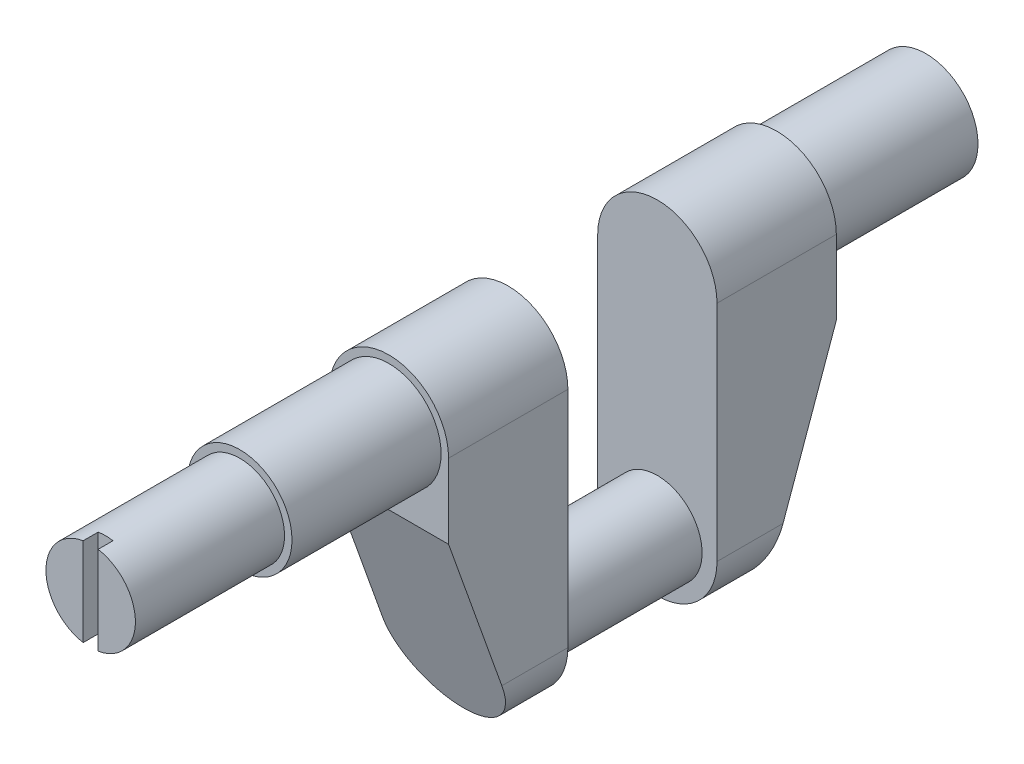
ISO-10303-21;
HEADER;
FILE_DESCRIPTION(('STEP AP214'),'2;1');
FILE_NAME('part.step','',(''),(''),'','','');
FILE_SCHEMA(('AUTOMOTIVE_DESIGN { 1 0 10303 214 1 1 1 1 }'));
ENDSEC;
DATA;
#1=APPLICATION_CONTEXT('core data for automotive mechanical design processes');
#2=APPLICATION_PROTOCOL_DEFINITION('international standard','automotive_design',2000,#1);
#3=PRODUCT_CONTEXT('',#1,'mechanical');
#4=PRODUCT('Part','Part','',(#3));
#5=PRODUCT_RELATED_PRODUCT_CATEGORY('part','',(#4));
#6=PRODUCT_DEFINITION_FORMATION('','',#4);
#7=PRODUCT_DEFINITION_CONTEXT('part definition',#1,'design');
#8=PRODUCT_DEFINITION('design','',#6,#7);
#9=PRODUCT_DEFINITION_SHAPE('','',#8);
#10=(LENGTH_UNIT() NAMED_UNIT(*) SI_UNIT(.MILLI.,.METRE.));
#11=(NAMED_UNIT(*) PLANE_ANGLE_UNIT() SI_UNIT($,.RADIAN.));
#12=(NAMED_UNIT(*) SI_UNIT($,.STERADIAN.) SOLID_ANGLE_UNIT());
#13=UNCERTAINTY_MEASURE_WITH_UNIT(LENGTH_MEASURE(1.E-05),#10,'distance_accuracy_value','');
#14=(GEOMETRIC_REPRESENTATION_CONTEXT(3) GLOBAL_UNCERTAINTY_ASSIGNED_CONTEXT((#13)) GLOBAL_UNIT_ASSIGNED_CONTEXT((#10,
#11,#12)) REPRESENTATION_CONTEXT('',''));
#15=CARTESIAN_POINT('',(0.,0.,0.));
#16=DIRECTION('',(0.,0.,1.));
#17=DIRECTION('',(1.,0.,0.));
#18=AXIS2_PLACEMENT_3D('',#15,#16,#17);
#19=CARTESIAN_POINT('',(1.32575280215063,12.0467012794756,36.7349651815675));
#20=DIRECTION('',(-1.,0.,0.));
#21=DIRECTION('',(0.,0.,1.));
#22=AXIS2_PLACEMENT_3D('',#19,#20,#21);
#23=PLANE('',#22);
#24=DIRECTION('',(0.,0.,1.));
#25=VECTOR('',#24,1.);
#26=CARTESIAN_POINT('',(1.32575280215063,3.11721675198663,23.9016318482341));
#27=LINE('',#26,#25);
#28=CARTESIAN_POINT('',(1.32575280215063,3.11721675198663,35.4516318482342));
#29=VERTEX_POINT('',#28);
#30=CARTESIAN_POINT('',(1.32575280215063,3.11721675198663,36.7349651815675));
#31=VERTEX_POINT('',#30);
#32=EDGE_CURVE('E59',#29,#31,#27,.T.);
#33=ORIENTED_EDGE('',*,*,#32,.F.);
#34=DIRECTION('',(0.,-1.,0.));
#35=VECTOR('',#34,1.);
#36=CARTESIAN_POINT('',(1.32575280215063,1.78003461280888,35.4516318482342));
#37=LINE('',#36,#35);
#38=CARTESIAN_POINT('',(1.32575280215063,10.7095191402978,35.4516318482342));
#39=VERTEX_POINT('',#38);
#40=EDGE_CURVE('E50',#39,#29,#37,.T.);
#41=ORIENTED_EDGE('',*,*,#40,.F.);
#42=DIRECTION('',(0.,0.,-1.));
#43=VECTOR('',#42,1.);
#44=CARTESIAN_POINT('',(1.32575280215063,10.7095191402978,23.9016318482341));
#45=LINE('',#44,#43);
#46=CARTESIAN_POINT('',(1.32575280215063,10.7095191402978,36.7349651815675));
#47=VERTEX_POINT('',#46);
#48=EDGE_CURVE('E347',#47,#39,#45,.T.);
#49=ORIENTED_EDGE('',*,*,#48,.F.);
#50=DIRECTION('',(0.,1.,0.));
#51=VECTOR('',#50,1.);
#52=CARTESIAN_POINT('',(1.32575280215063,9.48003461280889,36.7349651815675));
#53=LINE('',#52,#51);
#54=EDGE_CURVE('E199',#31,#47,#53,.T.);
#55=ORIENTED_EDGE('',*,*,#54,.F.);
#56=EDGE_LOOP('',(#33,#41,#49,#55));
#57=FACE_BOUND('',#56,.T.);
#58=ADVANCED_FACE('F39',(#57),#23,.F.);
#59=CARTESIAN_POINT('',(2.60908613548396,1.78003461280888,36.7349651815675));
#60=DIRECTION('',(1.,0.,0.));
#61=DIRECTION('',(0.,0.,-1.));
#62=AXIS2_PLACEMENT_3D('',#59,#60,#61);
#63=PLANE('',#62);
#64=DIRECTION('',(0.,0.,-1.));
#65=VECTOR('',#64,1.);
#66=CARTESIAN_POINT('',(2.60908613548396,3.11721675198663,23.9016318482341));
#67=LINE('',#66,#65);
#68=CARTESIAN_POINT('',(2.60908613548396,3.11721675198663,36.7349651815675));
#69=VERTEX_POINT('',#68);
#70=CARTESIAN_POINT('',(2.60908613548396,3.11721675198663,35.4516318482342));
#71=VERTEX_POINT('',#70);
#72=EDGE_CURVE('E201',#69,#71,#67,.T.);
#73=ORIENTED_EDGE('',*,*,#72,.F.);
#74=DIRECTION('',(0.,-1.,0.));
#75=VECTOR('',#74,1.);
#76=CARTESIAN_POINT('',(2.60908613548396,4.34670127947555,36.7349651815675));
#77=LINE('',#76,#75);
#78=CARTESIAN_POINT('',(2.60908613548396,10.7095191402978,36.7349651815675));
#79=VERTEX_POINT('',#78);
#80=EDGE_CURVE('E261',#79,#69,#77,.T.);
#81=ORIENTED_EDGE('',*,*,#80,.F.);
#82=DIRECTION('',(0.,0.,1.));
#83=VECTOR('',#82,1.);
#84=CARTESIAN_POINT('',(2.60908613548396,10.7095191402978,23.9016318482341));
#85=LINE('',#84,#83);
#86=CARTESIAN_POINT('',(2.60908613548396,10.7095191402978,35.4516318482342));
#87=VERTEX_POINT('',#86);
#88=EDGE_CURVE('E218',#87,#79,#85,.T.);
#89=ORIENTED_EDGE('',*,*,#88,.F.);
#90=DIRECTION('',(0.,1.,0.));
#91=VECTOR('',#90,1.);
#92=CARTESIAN_POINT('',(2.60908613548396,12.0467012794756,35.4516318482342));
#93=LINE('',#92,#91);
#94=EDGE_CURVE('E11',#71,#87,#93,.T.);
#95=ORIENTED_EDGE('',*,*,#94,.F.);
#96=EDGE_LOOP('',(#73,#81,#89,#95));
#97=FACE_BOUND('',#96,.T.);
#98=ADVANCED_FACE('F41',(#97),#63,.F.);
#99=CARTESIAN_POINT('',(1.96741946881729,6.91336794614222,35.4516318482342));
#100=DIRECTION('',(0.,0.,1.));
#101=DIRECTION('',(1.,0.,0.));
#102=AXIS2_PLACEMENT_3D('',#99,#100,#101);
#103=PLANE('',#102);
#104=CARTESIAN_POINT('',(1.96741946881729,6.91336794614222,35.4516318482342));
#105=DIRECTION('',(0.,0.,-1.));
#106=DIRECTION('',(-1.,0.,0.));
#107=AXIS2_PLACEMENT_3D('',#104,#105,#106);
#108=CIRCLE('',#107,3.85);
#109=EDGE_CURVE('E204',#71,#29,#108,.T.);
#110=ORIENTED_EDGE('',*,*,#109,.F.);
#111=ORIENTED_EDGE('',*,*,#94,.T.);
#112=CARTESIAN_POINT('',(1.96741946881729,6.91336794614222,35.4516318482342));
#113=DIRECTION('',(0.,0.,-1.));
#114=DIRECTION('',(-1.,0.,0.));
#115=AXIS2_PLACEMENT_3D('',#112,#113,#114);
#116=CIRCLE('',#115,3.85);
#117=EDGE_CURVE('E258',#39,#87,#116,.T.);
#118=ORIENTED_EDGE('',*,*,#117,.F.);
#119=ORIENTED_EDGE('',*,*,#40,.T.);
#120=EDGE_LOOP('',(#110,#111,#118,#119));
#121=FACE_BOUND('',#120,.T.);
#122=ADVANCED_FACE('F289',(#121),#103,.T.);
#123=CARTESIAN_POINT('',(1.96741946881729,6.91336794614222,36.7349651815675));
#124=DIRECTION('',(0.,0.,-1.));
#125=DIRECTION('',(-1.,0.,0.));
#126=AXIS2_PLACEMENT_3D('',#123,#124,#125);
#127=PLANE('',#126);
#128=ORIENTED_EDGE('',*,*,#80,.T.);
#129=CARTESIAN_POINT('',(1.96741946881729,6.91336794614222,36.7349651815675));
#130=DIRECTION('',(0.,0.,-1.));
#131=DIRECTION('',(-1.,0.,0.));
#132=AXIS2_PLACEMENT_3D('',#129,#130,#131);
#133=CIRCLE('',#132,3.85);
#134=EDGE_CURVE('E203',#79,#69,#133,.T.);
#135=ORIENTED_EDGE('',*,*,#134,.F.);
#136=EDGE_LOOP('',(#128,#135));
#137=FACE_BOUND('',#136,.T.);
#138=ADVANCED_FACE('F307',(#137),#127,.F.);
#139=CARTESIAN_POINT('',(1.96741946881729,6.91336794614222,36.7349651815675));
#140=DIRECTION('',(0.,0.,-1.));
#141=DIRECTION('',(-1.,0.,0.));
#142=AXIS2_PLACEMENT_3D('',#139,#140,#141);
#143=PLANE('',#142);
#144=ORIENTED_EDGE('',*,*,#54,.T.);
#145=CARTESIAN_POINT('',(1.96741946881729,6.91336794614222,36.7349651815675));
#146=DIRECTION('',(0.,0.,-1.));
#147=DIRECTION('',(-1.,0.,0.));
#148=AXIS2_PLACEMENT_3D('',#145,#146,#147);
#149=CIRCLE('',#148,3.85);
#150=EDGE_CURVE('E343',#31,#47,#149,.T.);
#151=ORIENTED_EDGE('',*,*,#150,.F.);
#152=EDGE_LOOP('',(#144,#151));
#153=FACE_BOUND('',#152,.T.);
#154=ADVANCED_FACE('F310',(#153),#143,.F.);
#155=CARTESIAN_POINT('',(7.10075280215063,-17.4699653871911,-15.8817014850992));
#156=DIRECTION('',(0.,-0.336336396998156,-0.941741911594837));
#157=DIRECTION('',(-1.,0.,0.));
#158=AXIS2_PLACEMENT_3D('',#155,#156,#157);
#159=PLANE('',#158);
#160=DIRECTION('',(0.,-0.941741911594838,0.336336396998156));
#161=VECTOR('',#160,1.);
#162=CARTESIAN_POINT('',(-3.16591386451604,-15.8033741353057,-16.4769126464868));
#163=LINE('',#162,#161);
#164=CARTESIAN_POINT('',(-3.16591386451604,0.496701279475554,-22.2983681517659));
#165=VERTEX_POINT('',#164);
#166=CARTESIAN_POINT('',(-3.16591386451604,-12.3366320538578,-17.7150348184325));
#167=VERTEX_POINT('',#166);
#168=EDGE_CURVE('E339',#165,#167,#163,.T.);
#169=ORIENTED_EDGE('',*,*,#168,.F.);
#170=DIRECTION('',(-1.,0.,0.));
#171=VECTOR('',#170,1.);
#172=CARTESIAN_POINT('',(4.53408613548396,0.496701279475555,-22.2983681517659));
#173=LINE('',#172,#171);
#174=CARTESIAN_POINT('',(7.10075280215063,0.496701279475554,-22.2983681517659));
#175=VERTEX_POINT('',#174);
#176=EDGE_CURVE('E262',#175,#165,#173,.T.);
#177=ORIENTED_EDGE('',*,*,#176,.F.);
#178=DIRECTION('',(0.,0.941741911594838,-0.336336396998156));
#179=VECTOR('',#178,1.);
#180=CARTESIAN_POINT('',(7.10075280215063,-7.26717504028312,-19.5255551804235));
#181=LINE('',#180,#179);
#182=CARTESIAN_POINT('',(7.10075280215063,-12.3366320538578,-17.7150348184325));
#183=VERTEX_POINT('',#182);
#184=EDGE_CURVE('E373',#183,#175,#181,.T.);
#185=ORIENTED_EDGE('',*,*,#184,.F.);
#186=CARTESIAN_POINT('',(1.96741946881729,-12.3366320538578,-17.7150348184325));
#187=DIRECTION('',(0.,0.336336396998156,0.941741911594837));
#188=DIRECTION('',(0.,-0.941741911594837,0.336336396998156));
#189=AXIS2_PLACEMENT_3D('',#186,#187,#188);
#190=ELLIPSE('',#189,5.45089187401679,5.13333333333333);
#191=EDGE_CURVE('E205',#167,#183,#190,.T.);
#192=ORIENTED_EDGE('',*,*,#191,.F.);
#193=EDGE_LOOP('',(#169,#177,#185,#192));
#194=FACE_BOUND('',#193,.T.);
#195=ADVANCED_FACE('F314',(#194),#159,.T.);
#196=CARTESIAN_POINT('',(-3.16591386451604,-12.3366320538578,-12.0317014850992));
#197=DIRECTION('',(1.,0.,0.));
#198=DIRECTION('',(0.,0.,-1.));
#199=AXIS2_PLACEMENT_3D('',#196,#197,#198);
#200=PLANE('',#199);
#201=ORIENTED_EDGE('',*,*,#168,.T.);
#202=DIRECTION('',(0.,0.,-1.));
#203=VECTOR('',#202,1.);
#204=CARTESIAN_POINT('',(-3.16591386451604,-12.3366320538578,-12.0317014850992));
#205=LINE('',#204,#203);
#206=CARTESIAN_POINT('',(-3.16591386451604,-12.3366320538578,-12.0317014850992));
#207=VERTEX_POINT('',#206);
#208=EDGE_CURVE('E209',#207,#167,#205,.T.);
#209=ORIENTED_EDGE('',*,*,#208,.F.);
#210=DIRECTION('',(0.,-1.,0.));
#211=VECTOR('',#210,1.);
#212=CARTESIAN_POINT('',(-3.16591386451604,6.91336794614222,-12.0317014850992));
#213=LINE('',#212,#211);
#214=CARTESIAN_POINT('',(-3.16591386451604,6.91336794614222,-12.0317014850992));
#215=VERTEX_POINT('',#214);
#216=EDGE_CURVE('E226',#215,#207,#213,.T.);
#217=ORIENTED_EDGE('',*,*,#216,.F.);
#218=DIRECTION('',(0.,0.,-1.));
#219=VECTOR('',#218,1.);
#220=CARTESIAN_POINT('',(-3.16591386451604,6.91336794614222,-12.0317014850992));
#221=LINE('',#220,#219);
#222=CARTESIAN_POINT('',(-3.16591386451604,6.91336794614222,-22.2983681517659));
#223=VERTEX_POINT('',#222);
#224=EDGE_CURVE('E208',#215,#223,#221,.T.);
#225=ORIENTED_EDGE('',*,*,#224,.T.);
#226=DIRECTION('',(0.,1.,0.));
#227=VECTOR('',#226,1.);
#228=CARTESIAN_POINT('',(-3.16591386451604,6.91336794614222,-22.2983681517659));
#229=LINE('',#228,#227);
#230=EDGE_CURVE('E231',#165,#223,#229,.T.);
#231=ORIENTED_EDGE('',*,*,#230,.F.);
#232=EDGE_LOOP('',(#201,#209,#217,#225,#231));
#233=FACE_BOUND('',#232,.T.);
#234=ADVANCED_FACE('F317',(#233),#200,.F.);
#235=CARTESIAN_POINT('',(1.96741946881729,-12.3366320538578,-12.0317014850992));
#236=DIRECTION('',(0.,0.,-1.));
#237=DIRECTION('',(-1.,0.,0.));
#238=AXIS2_PLACEMENT_3D('',#235,#236,#237);
#239=CYLINDRICAL_SURFACE('',#238,5.13333333333333);
#240=ORIENTED_EDGE('',*,*,#191,.T.);
#241=DIRECTION('',(0.,0.,-1.));
#242=VECTOR('',#241,1.);
#243=CARTESIAN_POINT('',(7.10075280215063,-12.3366320538578,-12.0317014850992));
#244=LINE('',#243,#242);
#245=CARTESIAN_POINT('',(7.10075280215063,-12.3366320538578,-12.0317014850992));
#246=VERTEX_POINT('',#245);
#247=EDGE_CURVE('E342',#246,#183,#244,.T.);
#248=ORIENTED_EDGE('',*,*,#247,.F.);
#249=CARTESIAN_POINT('',(1.96741946881729,-12.3366320538578,-12.0317014850992));
#250=DIRECTION('',(0.,0.,1.));
#251=DIRECTION('',(-1.,0.,0.));
#252=AXIS2_PLACEMENT_3D('',#249,#250,#251);
#253=CIRCLE('',#252,5.13333333333333);
#254=EDGE_CURVE('E223',#207,#246,#253,.T.);
#255=ORIENTED_EDGE('',*,*,#254,.F.);
#256=ORIENTED_EDGE('',*,*,#208,.T.);
#257=EDGE_LOOP('',(#240,#248,#255,#256));
#258=FACE_BOUND('',#257,.T.);
#259=ADVANCED_FACE('F413',(#258),#239,.T.);
#260=CARTESIAN_POINT('',(1.96741946881729,6.91336794614222,-22.2983681517659));
#261=DIRECTION('',(0.,0.,-1.));
#262=DIRECTION('',(-1.,0.,0.));
#263=AXIS2_PLACEMENT_3D('',#260,#261,#262);
#264=CYLINDRICAL_SURFACE('',#263,4.49166666666667);
#265=CARTESIAN_POINT('',(1.96741946881729,6.91336794614222,-35.1317014850992));
#266=DIRECTION('',(0.,0.,-1.));
#267=DIRECTION('',(-1.,0.,0.));
#268=AXIS2_PLACEMENT_3D('',#265,#266,#267);
#269=CIRCLE('',#268,4.49166666666667);
#270=CARTESIAN_POINT('',(6.45908613548396,6.91336794614222,-35.1317014850992));
#271=VERTEX_POINT('',#270);
#272=EDGE_CURVE('E213',#271,#271,#269,.T.);
#273=ORIENTED_EDGE('',*,*,#272,.F.);
#274=EDGE_LOOP('',(#273));
#275=FACE_BOUND('',#274,.T.);
#276=CARTESIAN_POINT('',(1.96741946881729,6.91336794614222,-22.2983681517659));
#277=DIRECTION('',(0.,0.,-1.));
#278=DIRECTION('',(-1.,0.,0.));
#279=AXIS2_PLACEMENT_3D('',#276,#277,#278);
#280=CIRCLE('',#279,4.49166666666667);
#281=CARTESIAN_POINT('',(6.45908613548396,6.91336794614222,-22.2983681517659));
#282=VERTEX_POINT('',#281);
#283=EDGE_CURVE('E210',#282,#282,#280,.T.);
#284=ORIENTED_EDGE('',*,*,#283,.T.);
#285=EDGE_LOOP('',(#284));
#286=FACE_BOUND('',#285,.T.);
#287=ADVANCED_FACE('F410',(#275,#286),#264,.T.);
#288=CARTESIAN_POINT('',(1.96741946881729,6.91336794614222,-35.1317014850992));
#289=DIRECTION('',(0.,0.,-1.));
#290=DIRECTION('',(-1.,0.,0.));
#291=AXIS2_PLACEMENT_3D('',#288,#289,#290);
#292=PLANE('',#291);
#293=ORIENTED_EDGE('',*,*,#272,.T.);
#294=EDGE_LOOP('',(#293));
#295=FACE_BOUND('',#294,.T.);
#296=ADVANCED_FACE('F398',(#295),#292,.T.);
#297=CARTESIAN_POINT('',(1.96741946881729,6.91336794614222,-12.0317014850992));
#298=DIRECTION('',(0.,0.,-1.));
#299=DIRECTION('',(1.,0.,0.));
#300=AXIS2_PLACEMENT_3D('',#297,#298,#299);
#301=CYLINDRICAL_SURFACE('',#300,5.13333333333333);
#302=CARTESIAN_POINT('',(1.96741946881729,6.91336794614222,-22.2983681517659));
#303=DIRECTION('',(0.,0.,-1.));
#304=DIRECTION('',(1.,0.,0.));
#305=AXIS2_PLACEMENT_3D('',#302,#303,#304);
#306=CIRCLE('',#305,5.13333333333333);
#307=CARTESIAN_POINT('',(7.10075280215063,6.91336794614222,-22.2983681517659));
#308=VERTEX_POINT('',#307);
#309=EDGE_CURVE('E228',#223,#308,#306,.T.);
#310=ORIENTED_EDGE('',*,*,#309,.F.);
#311=ORIENTED_EDGE('',*,*,#224,.F.);
#312=CARTESIAN_POINT('',(1.96741946881729,6.91336794614222,-12.0317014850992));
#313=DIRECTION('',(0.,0.,1.));
#314=DIRECTION('',(1.,0.,0.));
#315=AXIS2_PLACEMENT_3D('',#312,#313,#314);
#316=CIRCLE('',#315,5.13333333333333);
#317=CARTESIAN_POINT('',(7.10075280215063,6.91336794614222,-12.0317014850992));
#318=VERTEX_POINT('',#317);
#319=EDGE_CURVE('E351',#318,#215,#316,.T.);
#320=ORIENTED_EDGE('',*,*,#319,.F.);
#321=DIRECTION('',(0.,0.,-1.));
#322=VECTOR('',#321,1.);
#323=CARTESIAN_POINT('',(7.10075280215063,6.91336794614222,-12.0317014850992));
#324=LINE('',#323,#322);
#325=EDGE_CURVE('E252',#318,#308,#324,.T.);
#326=ORIENTED_EDGE('',*,*,#325,.T.);
#327=EDGE_LOOP('',(#310,#311,#320,#326));
#328=FACE_BOUND('',#327,.T.);
#329=ADVANCED_FACE('F418',(#328),#301,.T.);
#330=CARTESIAN_POINT('',(7.10075280215063,6.91336794614222,-12.0317014850992));
#331=DIRECTION('',(-1.,0.,0.));
#332=DIRECTION('',(0.,0.,1.));
#333=AXIS2_PLACEMENT_3D('',#330,#331,#332);
#334=PLANE('',#333);
#335=ORIENTED_EDGE('',*,*,#184,.T.);
#336=DIRECTION('',(0.,-1.,0.));
#337=VECTOR('',#336,1.);
#338=CARTESIAN_POINT('',(7.10075280215063,-12.3366320538578,-22.2983681517659));
#339=LINE('',#338,#337);
#340=EDGE_CURVE('E232',#308,#175,#339,.T.);
#341=ORIENTED_EDGE('',*,*,#340,.F.);
#342=ORIENTED_EDGE('',*,*,#325,.F.);
#343=DIRECTION('',(0.,1.,0.));
#344=VECTOR('',#343,1.);
#345=CARTESIAN_POINT('',(7.10075280215063,-12.3366320538578,-12.0317014850992));
#346=LINE('',#345,#344);
#347=EDGE_CURVE('E227',#246,#318,#346,.T.);
#348=ORIENTED_EDGE('',*,*,#347,.F.);
#349=ORIENTED_EDGE('',*,*,#247,.T.);
#350=EDGE_LOOP('',(#335,#341,#342,#348,#349));
#351=FACE_BOUND('',#350,.T.);
#352=ADVANCED_FACE('F408',(#351),#334,.F.);
#353=CARTESIAN_POINT('',(1.96741946881729,-2.71163205385778,-12.0317014850992));
#354=DIRECTION('',(0.,0.,1.));
#355=DIRECTION('',(1.,0.,0.));
#356=AXIS2_PLACEMENT_3D('',#353,#354,#355);
#357=PLANE('',#356);
#358=CARTESIAN_POINT('',(1.96741946881729,-12.3366320538578,-12.0317014850992));
#359=DIRECTION('',(0.,0.,1.));
#360=DIRECTION('',(1.,0.,0.));
#361=AXIS2_PLACEMENT_3D('',#358,#359,#360);
#362=CIRCLE('',#361,3.85);
#363=CARTESIAN_POINT('',(-1.88258053118271,-12.3366320538578,-12.0317014850992));
#364=VERTEX_POINT('',#363);
#365=EDGE_CURVE('E363',#364,#364,#362,.T.);
#366=ORIENTED_EDGE('',*,*,#365,.F.);
#367=EDGE_LOOP('',(#366));
#368=FACE_BOUND('',#367,.T.);
#369=ORIENTED_EDGE('',*,*,#216,.T.);
#370=ORIENTED_EDGE('',*,*,#254,.T.);
#371=ORIENTED_EDGE('',*,*,#347,.T.);
#372=ORIENTED_EDGE('',*,*,#319,.T.);
#373=EDGE_LOOP('',(#369,#370,#371,#372));
#374=FACE_BOUND('',#373,.T.);
#375=ADVANCED_FACE('F402',(#368,#374),#357,.T.);
#376=CARTESIAN_POINT('',(1.96741946881729,-2.71163205385778,-22.2983681517659));
#377=DIRECTION('',(0.,0.,1.));
#378=DIRECTION('',(1.,0.,0.));
#379=AXIS2_PLACEMENT_3D('',#376,#377,#378);
#380=PLANE('',#379);
#381=ORIENTED_EDGE('',*,*,#176,.T.);
#382=ORIENTED_EDGE('',*,*,#230,.T.);
#383=ORIENTED_EDGE('',*,*,#309,.T.);
#384=ORIENTED_EDGE('',*,*,#340,.T.);
#385=EDGE_LOOP('',(#381,#382,#383,#384));
#386=FACE_BOUND('',#385,.T.);
#387=ORIENTED_EDGE('',*,*,#283,.F.);
#388=EDGE_LOOP('',(#387));
#389=FACE_BOUND('',#388,.T.);
#390=ADVANCED_FACE('F296',(#386,#389),#380,.F.);
#391=CARTESIAN_POINT('',(7.10075280215063,-17.4699653871911,4.65163184823415));
#392=DIRECTION('',(0.,0.336336396998156,-0.941741911594837));
#393=DIRECTION('',(-1.,0.,0.));
#394=AXIS2_PLACEMENT_3D('',#391,#392,#393);
#395=PLANE('',#394);
#396=DIRECTION('',(0.,0.941741911594838,0.336336396998156));
#397=VECTOR('',#396,1.);
#398=CARTESIAN_POINT('',(-3.16591386451604,-15.8033741353057,5.24684300962178));
#399=LINE('',#398,#397);
#400=CARTESIAN_POINT('',(-3.16591386451604,-12.3366320538578,6.48496518156748));
#401=VERTEX_POINT('',#400);
#402=CARTESIAN_POINT('',(-3.16591386451604,0.496701279475554,11.0682985149008));
#403=VERTEX_POINT('',#402);
#404=EDGE_CURVE('E334',#401,#403,#399,.T.);
#405=ORIENTED_EDGE('',*,*,#404,.F.);
#406=CARTESIAN_POINT('',(1.96741946881729,-12.3366320538578,6.48496518156748));
#407=DIRECTION('',(0.,0.336336396998156,-0.941741911594837));
#408=DIRECTION('',(0.,-0.941741911594837,-0.336336396998156));
#409=AXIS2_PLACEMENT_3D('',#406,#407,#408);
#410=ELLIPSE('',#409,5.45089187401679,5.13333333333333);
#411=CARTESIAN_POINT('',(7.10075280215063,-12.3366320538578,6.48496518156748));
#412=VERTEX_POINT('',#411);
#413=EDGE_CURVE('E238',#412,#401,#410,.T.);
#414=ORIENTED_EDGE('',*,*,#413,.F.);
#415=DIRECTION('',(0.,-0.941741911594838,-0.336336396998156));
#416=VECTOR('',#415,1.);
#417=CARTESIAN_POINT('',(7.10075280215063,-7.26717504028312,8.29548554355843));
#418=LINE('',#417,#416);
#419=CARTESIAN_POINT('',(7.10075280215063,0.496701279475554,11.0682985149008));
#420=VERTEX_POINT('',#419);
#421=EDGE_CURVE('E195',#420,#412,#418,.T.);
#422=ORIENTED_EDGE('',*,*,#421,.F.);
#423=DIRECTION('',(1.,0.,0.));
#424=VECTOR('',#423,1.);
#425=CARTESIAN_POINT('',(4.53408613548396,0.496701279475555,11.0682985149008));
#426=LINE('',#425,#424);
#427=EDGE_CURVE('E172',#403,#420,#426,.T.);
#428=ORIENTED_EDGE('',*,*,#427,.F.);
#429=EDGE_LOOP('',(#405,#414,#422,#428));
#430=FACE_BOUND('',#429,.T.);
#431=ADVANCED_FACE('F292',(#430),#395,.F.);
#432=CARTESIAN_POINT('',(-3.16591386451604,-12.3366320538578,0.801631848234147));
#433=DIRECTION('',(-1.,0.,0.));
#434=DIRECTION('',(0.,0.,1.));
#435=AXIS2_PLACEMENT_3D('',#432,#433,#434);
#436=PLANE('',#435);
#437=ORIENTED_EDGE('',*,*,#404,.T.);
#438=DIRECTION('',(0.,1.,0.));
#439=VECTOR('',#438,1.);
#440=CARTESIAN_POINT('',(-3.16591386451604,6.91336794614222,11.0682985149008));
#441=LINE('',#440,#439);
#442=CARTESIAN_POINT('',(-3.16591386451604,6.91336794614222,11.0682985149008));
#443=VERTEX_POINT('',#442);
#444=EDGE_CURVE('E256',#403,#443,#441,.T.);
#445=ORIENTED_EDGE('',*,*,#444,.T.);
#446=DIRECTION('',(0.,0.,1.));
#447=VECTOR('',#446,1.);
#448=CARTESIAN_POINT('',(-3.16591386451604,6.91336794614222,0.801631848234147));
#449=LINE('',#448,#447);
#450=CARTESIAN_POINT('',(-3.16591386451604,6.91336794614222,0.801631848234147));
#451=VERTEX_POINT('',#450);
#452=EDGE_CURVE('E151',#451,#443,#449,.T.);
#453=ORIENTED_EDGE('',*,*,#452,.F.);
#454=DIRECTION('',(0.,-1.,0.));
#455=VECTOR('',#454,1.);
#456=CARTESIAN_POINT('',(-3.16591386451604,6.91336794614222,0.801631848234147));
#457=LINE('',#456,#455);
#458=CARTESIAN_POINT('',(-3.16591386451604,-12.3366320538578,0.801631848234147));
#459=VERTEX_POINT('',#458);
#460=EDGE_CURVE('E254',#451,#459,#457,.T.);
#461=ORIENTED_EDGE('',*,*,#460,.T.);
#462=DIRECTION('',(0.,0.,1.));
#463=VECTOR('',#462,1.);
#464=CARTESIAN_POINT('',(-3.16591386451604,-12.3366320538578,0.801631848234147));
#465=LINE('',#464,#463);
#466=EDGE_CURVE('E243',#459,#401,#465,.T.);
#467=ORIENTED_EDGE('',*,*,#466,.T.);
#468=EDGE_LOOP('',(#437,#445,#453,#461,#467));
#469=FACE_BOUND('',#468,.T.);
#470=ADVANCED_FACE('F295',(#469),#436,.T.);
#471=CARTESIAN_POINT('',(1.96741946881729,-12.3366320538578,0.801631848234147));
#472=DIRECTION('',(0.,0.,-1.));
#473=DIRECTION('',(-1.,0.,0.));
#474=AXIS2_PLACEMENT_3D('',#471,#472,#473);
#475=CYLINDRICAL_SURFACE('',#474,5.13333333333333);
#476=ORIENTED_EDGE('',*,*,#413,.T.);
#477=ORIENTED_EDGE('',*,*,#466,.F.);
#478=CARTESIAN_POINT('',(1.96741946881729,-12.3366320538578,0.801631848234147));
#479=DIRECTION('',(0.,0.,1.));
#480=DIRECTION('',(-1.,0.,0.));
#481=AXIS2_PLACEMENT_3D('',#478,#479,#480);
#482=CIRCLE('',#481,5.13333333333333);
#483=CARTESIAN_POINT('',(7.10075280215063,-12.3366320538578,0.801631848234147));
#484=VERTEX_POINT('',#483);
#485=EDGE_CURVE('E235',#459,#484,#482,.T.);
#486=ORIENTED_EDGE('',*,*,#485,.T.);
#487=DIRECTION('',(0.,0.,1.));
#488=VECTOR('',#487,1.);
#489=CARTESIAN_POINT('',(7.10075280215063,-12.3366320538578,0.801631848234147));
#490=LINE('',#489,#488);
#491=EDGE_CURVE('E221',#484,#412,#490,.T.);
#492=ORIENTED_EDGE('',*,*,#491,.T.);
#493=EDGE_LOOP('',(#476,#477,#486,#492));
#494=FACE_BOUND('',#493,.T.);
#495=ADVANCED_FACE('F280',(#494),#475,.T.);
#496=CARTESIAN_POINT('',(1.96741946881729,-2.71163205385778,11.0682985149008));
#497=DIRECTION('',(0.,0.,1.));
#498=DIRECTION('',(1.,0.,0.));
#499=AXIS2_PLACEMENT_3D('',#496,#497,#498);
#500=PLANE('',#499);
#501=ORIENTED_EDGE('',*,*,#427,.T.);
#502=DIRECTION('',(0.,-1.,0.));
#503=VECTOR('',#502,1.);
#504=CARTESIAN_POINT('',(7.10075280215063,-12.3366320538578,11.0682985149008));
#505=LINE('',#504,#503);
#506=CARTESIAN_POINT('',(7.10075280215063,6.91336794614222,11.0682985149008));
#507=VERTEX_POINT('',#506);
#508=EDGE_CURVE('E168',#507,#420,#505,.T.);
#509=ORIENTED_EDGE('',*,*,#508,.F.);
#510=CARTESIAN_POINT('',(1.96741946881729,6.91336794614222,11.0682985149008));
#511=DIRECTION('',(0.,0.,-1.));
#512=DIRECTION('',(1.,0.,0.));
#513=AXIS2_PLACEMENT_3D('',#510,#511,#512);
#514=CIRCLE('',#513,5.13333333333333);
#515=EDGE_CURVE('E43',#443,#507,#514,.T.);
#516=ORIENTED_EDGE('',*,*,#515,.F.);
#517=ORIENTED_EDGE('',*,*,#444,.F.);
#518=EDGE_LOOP('',(#501,#509,#516,#517));
#519=FACE_BOUND('',#518,.T.);
#520=CARTESIAN_POINT('',(1.96741946881729,6.91336794614222,11.0682985149008));
#521=DIRECTION('',(0.,0.,-1.));
#522=DIRECTION('',(-1.,0.,0.));
#523=AXIS2_PLACEMENT_3D('',#520,#521,#522);
#524=CIRCLE('',#523,4.49166666666667);
#525=CARTESIAN_POINT('',(6.45908613548396,6.91336794614222,11.0682985149008));
#526=VERTEX_POINT('',#525);
#527=EDGE_CURVE('E222',#526,#526,#524,.T.);
#528=ORIENTED_EDGE('',*,*,#527,.T.);
#529=EDGE_LOOP('',(#528));
#530=FACE_BOUND('',#529,.T.);
#531=ADVANCED_FACE('F169',(#519,#530),#500,.T.);
#532=CARTESIAN_POINT('',(1.96741946881729,-12.3366320538578,0.801631848234147));
#533=DIRECTION('',(0.,0.,1.));
#534=DIRECTION('',(1.,0.,0.));
#535=AXIS2_PLACEMENT_3D('',#532,#533,#534);
#536=CYLINDRICAL_SURFACE('',#535,3.85);
#537=ORIENTED_EDGE('',*,*,#365,.T.);
#538=EDGE_LOOP('',(#537));
#539=FACE_BOUND('',#538,.T.);
#540=CARTESIAN_POINT('',(1.96741946881729,-12.3366320538578,0.801631848234147));
#541=DIRECTION('',(0.,0.,1.));
#542=DIRECTION('',(1.,0.,0.));
#543=AXIS2_PLACEMENT_3D('',#540,#541,#542);
#544=CIRCLE('',#543,3.85);
#545=CARTESIAN_POINT('',(-1.88258053118271,-12.3366320538578,0.801631848234147));
#546=VERTEX_POINT('',#545);
#547=EDGE_CURVE('E177',#546,#546,#544,.T.);
#548=ORIENTED_EDGE('',*,*,#547,.F.);
#549=EDGE_LOOP('',(#548));
#550=FACE_BOUND('',#549,.T.);
#551=ADVANCED_FACE('F268',(#539,#550),#536,.T.);
#552=CARTESIAN_POINT('',(1.96741946881729,6.91336794614222,23.9016318482341));
#553=DIRECTION('',(0.,0.,-1.));
#554=DIRECTION('',(-1.,0.,0.));
#555=AXIS2_PLACEMENT_3D('',#552,#553,#554);
#556=CYLINDRICAL_SURFACE('',#555,3.85);
#557=ORIENTED_EDGE('',*,*,#32,.T.);
#558=ORIENTED_EDGE('',*,*,#150,.T.);
#559=ORIENTED_EDGE('',*,*,#48,.T.);
#560=ORIENTED_EDGE('',*,*,#117,.T.);
#561=ORIENTED_EDGE('',*,*,#88,.T.);
#562=ORIENTED_EDGE('',*,*,#134,.T.);
#563=ORIENTED_EDGE('',*,*,#72,.T.);
#564=ORIENTED_EDGE('',*,*,#109,.T.);
#565=EDGE_LOOP('',(#557,#558,#559,#560,#561,#562,#563,#564));
#566=FACE_BOUND('',#565,.T.);
#567=CARTESIAN_POINT('',(1.96741946881729,6.91336794614222,23.9016318482341));
#568=DIRECTION('',(0.,0.,-1.));
#569=DIRECTION('',(-1.,0.,0.));
#570=AXIS2_PLACEMENT_3D('',#567,#568,#569);
#571=CIRCLE('',#570,3.85);
#572=CARTESIAN_POINT('',(5.81741946881729,6.91336794614222,23.9016318482341));
#573=VERTEX_POINT('',#572);
#574=EDGE_CURVE('E183',#573,#573,#571,.T.);
#575=ORIENTED_EDGE('',*,*,#574,.F.);
#576=EDGE_LOOP('',(#575));
#577=FACE_BOUND('',#576,.T.);
#578=ADVANCED_FACE('F270',(#566,#577),#556,.T.);
#579=CARTESIAN_POINT('',(1.96741946881729,6.91336794614222,11.0682985149008));
#580=DIRECTION('',(0.,0.,-1.));
#581=DIRECTION('',(-1.,0.,0.));
#582=AXIS2_PLACEMENT_3D('',#579,#580,#581);
#583=CYLINDRICAL_SURFACE('',#582,4.49166666666667);
#584=CARTESIAN_POINT('',(1.96741946881729,6.91336794614222,23.9016318482341));
#585=DIRECTION('',(0.,0.,-1.));
#586=DIRECTION('',(-1.,0.,0.));
#587=AXIS2_PLACEMENT_3D('',#584,#585,#586);
#588=CIRCLE('',#587,4.49166666666667);
#589=CARTESIAN_POINT('',(6.45908613548396,6.91336794614222,23.9016318482341));
#590=VERTEX_POINT('',#589);
#591=EDGE_CURVE('E234',#590,#590,#588,.T.);
#592=ORIENTED_EDGE('',*,*,#591,.T.);
#593=EDGE_LOOP('',(#592));
#594=FACE_BOUND('',#593,.T.);
#595=ORIENTED_EDGE('',*,*,#527,.F.);
#596=EDGE_LOOP('',(#595));
#597=FACE_BOUND('',#596,.T.);
#598=ADVANCED_FACE('F277',(#594,#597),#583,.T.);
#599=CARTESIAN_POINT('',(1.96741946881729,6.91336794614222,23.9016318482341));
#600=DIRECTION('',(0.,0.,-1.));
#601=DIRECTION('',(-1.,0.,0.));
#602=AXIS2_PLACEMENT_3D('',#599,#600,#601);
#603=PLANE('',#602);
#604=ORIENTED_EDGE('',*,*,#574,.T.);
#605=EDGE_LOOP('',(#604));
#606=FACE_BOUND('',#605,.T.);
#607=ORIENTED_EDGE('',*,*,#591,.F.);
#608=EDGE_LOOP('',(#607));
#609=FACE_BOUND('',#608,.T.);
#610=ADVANCED_FACE('F298',(#606,#609),#603,.F.);
#611=CARTESIAN_POINT('',(1.96741946881729,6.91336794614222,0.801631848234147));
#612=DIRECTION('',(0.,0.,-1.));
#613=DIRECTION('',(1.,0.,0.));
#614=AXIS2_PLACEMENT_3D('',#611,#612,#613);
#615=CYLINDRICAL_SURFACE('',#614,5.13333333333333);
#616=ORIENTED_EDGE('',*,*,#515,.T.);
#617=DIRECTION('',(0.,0.,1.));
#618=VECTOR('',#617,1.);
#619=CARTESIAN_POINT('',(7.10075280215063,6.91336794614222,0.801631848234147));
#620=LINE('',#619,#618);
#621=CARTESIAN_POINT('',(7.10075280215063,6.91336794614222,0.801631848234147));
#622=VERTEX_POINT('',#621);
#623=EDGE_CURVE('E176',#622,#507,#620,.T.);
#624=ORIENTED_EDGE('',*,*,#623,.F.);
#625=CARTESIAN_POINT('',(1.96741946881729,6.91336794614222,0.801631848234147));
#626=DIRECTION('',(0.,0.,1.));
#627=DIRECTION('',(1.,0.,0.));
#628=AXIS2_PLACEMENT_3D('',#625,#626,#627);
#629=CIRCLE('',#628,5.13333333333333);
#630=EDGE_CURVE('E184',#622,#451,#629,.T.);
#631=ORIENTED_EDGE('',*,*,#630,.T.);
#632=ORIENTED_EDGE('',*,*,#452,.T.);
#633=EDGE_LOOP('',(#616,#624,#631,#632));
#634=FACE_BOUND('',#633,.T.);
#635=ADVANCED_FACE('F180',(#634),#615,.T.);
#636=CARTESIAN_POINT('',(7.10075280215063,6.91336794614222,0.801631848234147));
#637=DIRECTION('',(1.,0.,0.));
#638=DIRECTION('',(0.,0.,-1.));
#639=AXIS2_PLACEMENT_3D('',#636,#637,#638);
#640=PLANE('',#639);
#641=ORIENTED_EDGE('',*,*,#421,.T.);
#642=ORIENTED_EDGE('',*,*,#491,.F.);
#643=DIRECTION('',(0.,1.,0.));
#644=VECTOR('',#643,1.);
#645=CARTESIAN_POINT('',(7.10075280215063,-12.3366320538578,0.801631848234147));
#646=LINE('',#645,#644);
#647=EDGE_CURVE('E188',#484,#622,#646,.T.);
#648=ORIENTED_EDGE('',*,*,#647,.T.);
#649=ORIENTED_EDGE('',*,*,#623,.T.);
#650=ORIENTED_EDGE('',*,*,#508,.T.);
#651=EDGE_LOOP('',(#641,#642,#648,#649,#650));
#652=FACE_BOUND('',#651,.T.);
#653=ADVANCED_FACE('F186',(#652),#640,.T.);
#654=CARTESIAN_POINT('',(1.96741946881729,-2.71163205385778,0.801631848234147));
#655=DIRECTION('',(0.,0.,1.));
#656=DIRECTION('',(1.,0.,0.));
#657=AXIS2_PLACEMENT_3D('',#654,#655,#656);
#658=PLANE('',#657);
#659=ORIENTED_EDGE('',*,*,#547,.T.);
#660=EDGE_LOOP('',(#659));
#661=FACE_BOUND('',#660,.T.);
#662=ORIENTED_EDGE('',*,*,#460,.F.);
#663=ORIENTED_EDGE('',*,*,#630,.F.);
#664=ORIENTED_EDGE('',*,*,#647,.F.);
#665=ORIENTED_EDGE('',*,*,#485,.F.);
#666=EDGE_LOOP('',(#662,#663,#664,#665));
#667=FACE_BOUND('',#666,.T.);
#668=ADVANCED_FACE('F265',(#661,#667),#658,.F.);
#669=CLOSED_SHELL('',(#58,#98,#122,#138,#154,#195,#234,#259,#287,#296,#329,#352,#375,#390,#431,
#470,#495,#531,#551,#578,#598,#610,#635,#653,#668));
#670=MANIFOLD_SOLID_BREP('B2',#669);
#671=ADVANCED_BREP_SHAPE_REPRESENTATION('',(#18,#670),#14);
#672=SHAPE_DEFINITION_REPRESENTATION(#9,#671);
ENDSEC;
END-ISO-10303-21;
